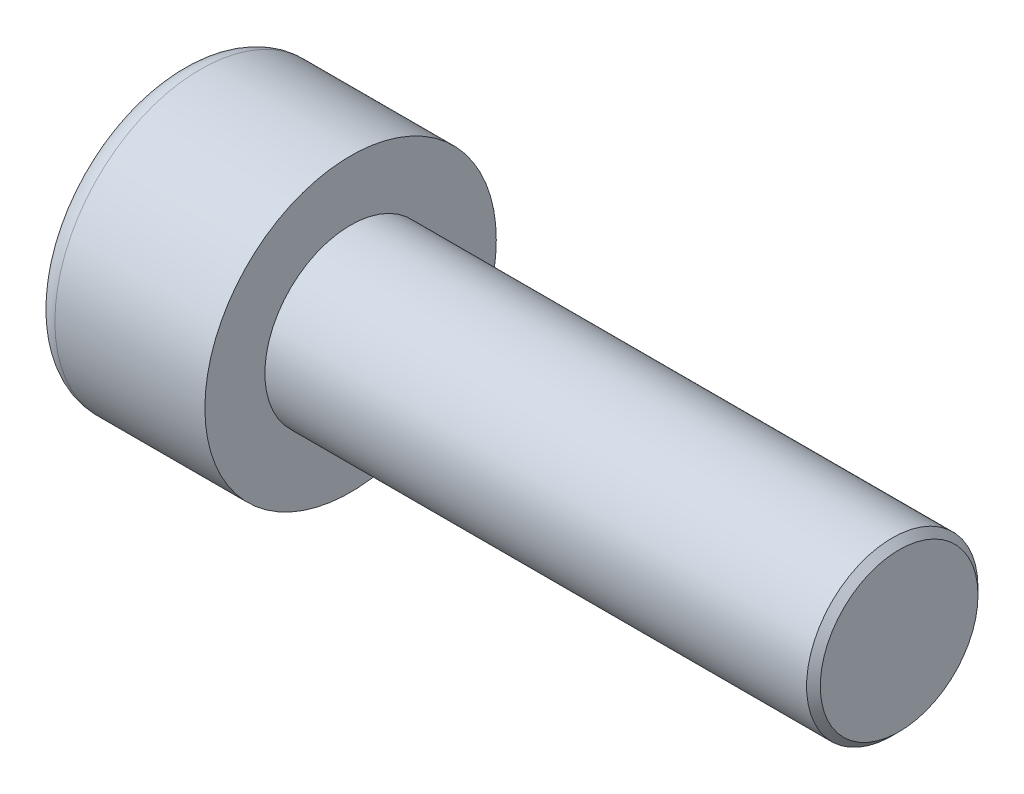
ISO-10303-21;
HEADER;
FILE_DESCRIPTION(('STEP AP214'),'2;1');
FILE_NAME('part.step','',(''),(''),'','','');
FILE_SCHEMA(('AUTOMOTIVE_DESIGN { 1 0 10303 214 1 1 1 1 }'));
ENDSEC;
DATA;
#1=APPLICATION_CONTEXT('core data for automotive mechanical design processes');
#2=APPLICATION_PROTOCOL_DEFINITION('international standard','automotive_design',2000,#1);
#3=PRODUCT_CONTEXT('',#1,'mechanical');
#4=PRODUCT('Part','Part','',(#3));
#5=PRODUCT_RELATED_PRODUCT_CATEGORY('part','',(#4));
#6=PRODUCT_DEFINITION_FORMATION('','',#4);
#7=PRODUCT_DEFINITION_CONTEXT('part definition',#1,'design');
#8=PRODUCT_DEFINITION('design','',#6,#7);
#9=PRODUCT_DEFINITION_SHAPE('','',#8);
#10=(LENGTH_UNIT() NAMED_UNIT(*) SI_UNIT(.MILLI.,.METRE.));
#11=(NAMED_UNIT(*) PLANE_ANGLE_UNIT() SI_UNIT($,.RADIAN.));
#12=(NAMED_UNIT(*) SI_UNIT($,.STERADIAN.) SOLID_ANGLE_UNIT());
#13=UNCERTAINTY_MEASURE_WITH_UNIT(LENGTH_MEASURE(1.E-05),#10,'distance_accuracy_value','');
#14=(GEOMETRIC_REPRESENTATION_CONTEXT(3) GLOBAL_UNCERTAINTY_ASSIGNED_CONTEXT((#13)) GLOBAL_UNIT_ASSIGNED_CONTEXT((#10,
#11,#12)) REPRESENTATION_CONTEXT('',''));
#15=CARTESIAN_POINT('',(0.,0.,0.));
#16=DIRECTION('',(0.,0.,1.));
#17=DIRECTION('',(1.,0.,0.));
#18=AXIS2_PLACEMENT_3D('',#15,#16,#17);
#19=CARTESIAN_POINT('',(2.5,0.,-2.3094010767585));
#20=DIRECTION('',(1.,0.,0.));
#21=DIRECTION('',(0.,0.,-1.));
#22=AXIS2_PLACEMENT_3D('',#19,#20,#21);
#23=PLANE('',#22);
#24=CARTESIAN_POINT('',(2.5,0.,0.));
#25=DIRECTION('',(1.,0.,0.));
#26=DIRECTION('',(0.,0.,-1.));
#27=AXIS2_PLACEMENT_3D('',#24,#25,#26);
#28=CIRCLE('',#27,2.);
#29=CARTESIAN_POINT('',(2.5,-1.,-1.73205080756888));
#30=VERTEX_POINT('',#29);
#31=CARTESIAN_POINT('',(2.5,-2.,0.));
#32=VERTEX_POINT('',#31);
#33=EDGE_CURVE('E160',#30,#32,#28,.F.);
#34=ORIENTED_EDGE('',*,*,#33,.F.);
#35=DIRECTION('',(0.,0.866025403784439,-0.5));
#36=VECTOR('',#35,1.);
#37=CARTESIAN_POINT('',(2.5,-2.,-1.15470053837925));
#38=LINE('',#37,#36);
#39=CARTESIAN_POINT('',(2.5,-2.,-1.15470053837925));
#40=VERTEX_POINT('',#39);
#41=EDGE_CURVE('E168',#40,#30,#38,.T.);
#42=ORIENTED_EDGE('',*,*,#41,.F.);
#43=DIRECTION('',(0.,0.,-1.));
#44=VECTOR('',#43,1.);
#45=CARTESIAN_POINT('',(2.5,-2.,1.15470053837925));
#46=LINE('',#45,#44);
#47=EDGE_CURVE('E185',#32,#40,#46,.T.);
#48=ORIENTED_EDGE('',*,*,#47,.F.);
#49=EDGE_LOOP('',(#34,#42,#48));
#50=FACE_BOUND('',#49,.T.);
#51=ADVANCED_FACE('F37',(#50),#23,.F.);
#52=CARTESIAN_POINT('',(2.5,-1.,1.73205080756888));
#53=VERTEX_POINT('',#52);
#54=EDGE_CURVE('E290',#32,#53,#28,.F.);
#55=ORIENTED_EDGE('',*,*,#54,.F.);
#56=CARTESIAN_POINT('',(2.5,-2.,1.15470053837925));
#57=VERTEX_POINT('',#56);
#58=EDGE_CURVE('E186',#57,#32,#46,.T.);
#59=ORIENTED_EDGE('',*,*,#58,.F.);
#60=DIRECTION('',(0.,-0.866025403784439,-0.5));
#61=VECTOR('',#60,1.);
#62=CARTESIAN_POINT('',(2.5,0.,2.3094010767585));
#63=LINE('',#62,#61);
#64=EDGE_CURVE('E181',#53,#57,#63,.T.);
#65=ORIENTED_EDGE('',*,*,#64,.F.);
#66=EDGE_LOOP('',(#55,#59,#65));
#67=FACE_BOUND('',#66,.T.);
#68=ADVANCED_FACE('F126',(#67),#23,.F.);
#69=CARTESIAN_POINT('',(2.5,1.,1.73205080756888));
#70=VERTEX_POINT('',#69);
#71=EDGE_CURVE('E286',#53,#70,#28,.F.);
#72=ORIENTED_EDGE('',*,*,#71,.F.);
#73=CARTESIAN_POINT('',(2.5,0.,2.3094010767585));
#74=VERTEX_POINT('',#73);
#75=EDGE_CURVE('E182',#74,#53,#63,.T.);
#76=ORIENTED_EDGE('',*,*,#75,.F.);
#77=DIRECTION('',(0.,-0.866025403784438,0.5));
#78=VECTOR('',#77,1.);
#79=CARTESIAN_POINT('',(2.5,2.,1.15470053837925));
#80=LINE('',#79,#78);
#81=EDGE_CURVE('E177',#70,#74,#80,.T.);
#82=ORIENTED_EDGE('',*,*,#81,.F.);
#83=EDGE_LOOP('',(#72,#76,#82));
#84=FACE_BOUND('',#83,.T.);
#85=ADVANCED_FACE('F132',(#84),#23,.F.);
#86=CARTESIAN_POINT('',(2.5,2.,0.));
#87=VERTEX_POINT('',#86);
#88=EDGE_CURVE('E157',#70,#87,#28,.F.);
#89=ORIENTED_EDGE('',*,*,#88,.F.);
#90=CARTESIAN_POINT('',(2.5,2.,1.15470053837925));
#91=VERTEX_POINT('',#90);
#92=EDGE_CURVE('E178',#91,#70,#80,.T.);
#93=ORIENTED_EDGE('',*,*,#92,.F.);
#94=DIRECTION('',(0.,0.,1.));
#95=VECTOR('',#94,1.);
#96=CARTESIAN_POINT('',(2.5,2.,-1.15470053837925));
#97=LINE('',#96,#95);
#98=EDGE_CURVE('E172',#87,#91,#97,.T.);
#99=ORIENTED_EDGE('',*,*,#98,.F.);
#100=EDGE_LOOP('',(#89,#93,#99));
#101=FACE_BOUND('',#100,.T.);
#102=ADVANCED_FACE('F146',(#101),#23,.F.);
#103=CARTESIAN_POINT('',(2.5,0.,0.));
#104=DIRECTION('',(1.,0.,0.));
#105=DIRECTION('',(0.,0.,-1.));
#106=AXIS2_PLACEMENT_3D('',#103,#104,#105);
#107=CIRCLE('',#106,2.);
#108=CARTESIAN_POINT('',(2.5,1.,-1.73205080756888));
#109=VERTEX_POINT('',#108);
#110=EDGE_CURVE('E52',#109,#87,#107,.T.);
#111=ORIENTED_EDGE('',*,*,#110,.T.);
#112=CARTESIAN_POINT('',(2.5,2.,-1.15470053837925));
#113=VERTEX_POINT('',#112);
#114=EDGE_CURVE('E165',#113,#87,#97,.T.);
#115=ORIENTED_EDGE('',*,*,#114,.F.);
#116=DIRECTION('',(0.,0.866025403784438,0.5));
#117=VECTOR('',#116,1.);
#118=CARTESIAN_POINT('',(2.5,0.,-2.3094010767585));
#119=LINE('',#118,#117);
#120=EDGE_CURVE('E162',#109,#113,#119,.T.);
#121=ORIENTED_EDGE('',*,*,#120,.F.);
#122=EDGE_LOOP('',(#111,#115,#121));
#123=FACE_BOUND('',#122,.T.);
#124=ADVANCED_FACE('F137',(#123),#23,.F.);
#125=EDGE_CURVE('E150',#109,#30,#28,.F.);
#126=ORIENTED_EDGE('',*,*,#125,.F.);
#127=CARTESIAN_POINT('',(2.5,0.,-2.3094010767585));
#128=VERTEX_POINT('',#127);
#129=EDGE_CURVE('E153',#128,#109,#119,.T.);
#130=ORIENTED_EDGE('',*,*,#129,.F.);
#131=EDGE_CURVE('E155',#30,#128,#38,.T.);
#132=ORIENTED_EDGE('',*,*,#131,.F.);
#133=EDGE_LOOP('',(#126,#130,#132));
#134=FACE_BOUND('',#133,.T.);
#135=ADVANCED_FACE('F128',(#134),#23,.F.);
#136=CARTESIAN_POINT('',(0.,0.,0.));
#137=DIRECTION('',(1.,0.,0.));
#138=DIRECTION('',(0.,0.,-1.));
#139=AXIS2_PLACEMENT_3D('',#136,#137,#138);
#140=PLANE('',#139);
#141=CARTESIAN_POINT('',(0.,0.,0.));
#142=DIRECTION('',(1.,0.,0.));
#143=DIRECTION('',(0.,0.,-1.));
#144=AXIS2_PLACEMENT_3D('',#141,#142,#143);
#145=CIRCLE('',#144,3.625);
#146=CARTESIAN_POINT('',(0.,0.,-3.625));
#147=VERTEX_POINT('',#146);
#148=EDGE_CURVE('E225',#147,#147,#145,.F.);
#149=ORIENTED_EDGE('',*,*,#148,.T.);
#150=EDGE_LOOP('',(#149));
#151=FACE_BOUND('',#150,.T.);
#152=DIRECTION('',(0.,0.866025403784439,-0.5));
#153=VECTOR('',#152,1.);
#154=CARTESIAN_POINT('',(0.,-2.,-1.15470053837925));
#155=LINE('',#154,#153);
#156=CARTESIAN_POINT('',(0.,-2.,-1.15470053837925));
#157=VERTEX_POINT('',#156);
#158=CARTESIAN_POINT('',(0.,0.,-2.3094010767585));
#159=VERTEX_POINT('',#158);
#160=EDGE_CURVE('E60',#157,#159,#155,.T.);
#161=ORIENTED_EDGE('',*,*,#160,.T.);
#162=DIRECTION('',(0.,0.866025403784438,0.5));
#163=VECTOR('',#162,1.);
#164=CARTESIAN_POINT('',(0.,0.,-2.3094010767585));
#165=LINE('',#164,#163);
#166=CARTESIAN_POINT('',(0.,2.,-1.15470053837925));
#167=VERTEX_POINT('',#166);
#168=EDGE_CURVE('E191',#159,#167,#165,.T.);
#169=ORIENTED_EDGE('',*,*,#168,.T.);
#170=DIRECTION('',(0.,0.,1.));
#171=VECTOR('',#170,1.);
#172=CARTESIAN_POINT('',(0.,2.,-1.15470053837925));
#173=LINE('',#172,#171);
#174=CARTESIAN_POINT('',(0.,2.,1.15470053837925));
#175=VERTEX_POINT('',#174);
#176=EDGE_CURVE('E194',#167,#175,#173,.T.);
#177=ORIENTED_EDGE('',*,*,#176,.T.);
#178=DIRECTION('',(0.,-0.866025403784438,0.5));
#179=VECTOR('',#178,1.);
#180=CARTESIAN_POINT('',(0.,2.,1.15470053837925));
#181=LINE('',#180,#179);
#182=CARTESIAN_POINT('',(0.,0.,2.3094010767585));
#183=VERTEX_POINT('',#182);
#184=EDGE_CURVE('E197',#175,#183,#181,.T.);
#185=ORIENTED_EDGE('',*,*,#184,.T.);
#186=DIRECTION('',(0.,-0.866025403784439,-0.5));
#187=VECTOR('',#186,1.);
#188=CARTESIAN_POINT('',(0.,0.,2.3094010767585));
#189=LINE('',#188,#187);
#190=CARTESIAN_POINT('',(0.,-2.,1.15470053837925));
#191=VERTEX_POINT('',#190);
#192=EDGE_CURVE('E200',#183,#191,#189,.T.);
#193=ORIENTED_EDGE('',*,*,#192,.T.);
#194=DIRECTION('',(0.,0.,-1.));
#195=VECTOR('',#194,1.);
#196=CARTESIAN_POINT('',(0.,-2.,1.15470053837925));
#197=LINE('',#196,#195);
#198=EDGE_CURVE('E203',#191,#157,#197,.T.);
#199=ORIENTED_EDGE('',*,*,#198,.T.);
#200=EDGE_LOOP('',(#161,#169,#177,#185,#193,#199));
#201=FACE_BOUND('',#200,.T.);
#202=ADVANCED_FACE('F136',(#151,#201),#140,.F.);
#203=CARTESIAN_POINT('',(5.,0.,0.));
#204=DIRECTION('',(1.,0.,0.));
#205=DIRECTION('',(0.,0.,-1.));
#206=AXIS2_PLACEMENT_3D('',#203,#204,#205);
#207=PLANE('',#206);
#208=CARTESIAN_POINT('',(5.,0.,0.));
#209=DIRECTION('',(1.,0.,0.));
#210=DIRECTION('',(0.,0.,-1.));
#211=AXIS2_PLACEMENT_3D('',#208,#209,#210);
#212=CIRCLE('',#211,4.25);
#213=CARTESIAN_POINT('',(5.,0.,-4.25));
#214=VERTEX_POINT('',#213);
#215=EDGE_CURVE('E158',#214,#214,#212,.T.);
#216=ORIENTED_EDGE('',*,*,#215,.T.);
#217=EDGE_LOOP('',(#216));
#218=FACE_BOUND('',#217,.T.);
#219=CARTESIAN_POINT('',(5.,0.,0.));
#220=DIRECTION('',(1.,0.,0.));
#221=DIRECTION('',(0.,0.,-1.));
#222=AXIS2_PLACEMENT_3D('',#219,#220,#221);
#223=CIRCLE('',#222,2.5);
#224=CARTESIAN_POINT('',(5.,0.,-2.5));
#225=VERTEX_POINT('',#224);
#226=EDGE_CURVE('E216',#225,#225,#223,.T.);
#227=ORIENTED_EDGE('',*,*,#226,.F.);
#228=EDGE_LOOP('',(#227));
#229=FACE_BOUND('',#228,.T.);
#230=ADVANCED_FACE('F143',(#218,#229),#207,.T.);
#231=CARTESIAN_POINT('',(5.,0.,0.));
#232=DIRECTION('',(-1.,0.,0.));
#233=DIRECTION('',(0.,0.,1.));
#234=AXIS2_PLACEMENT_3D('',#231,#232,#233);
#235=CYLINDRICAL_SURFACE('',#234,4.25);
#236=CARTESIAN_POINT('',(0.625,0.,0.));
#237=DIRECTION('',(1.,0.,0.));
#238=DIRECTION('',(0.,0.,-1.));
#239=AXIS2_PLACEMENT_3D('',#236,#237,#238);
#240=CIRCLE('',#239,4.25);
#241=CARTESIAN_POINT('',(0.625,0.,-4.25));
#242=VERTEX_POINT('',#241);
#243=EDGE_CURVE('E222',#242,#242,#240,.T.);
#244=ORIENTED_EDGE('',*,*,#243,.T.);
#245=EDGE_LOOP('',(#244));
#246=FACE_BOUND('',#245,.T.);
#247=ORIENTED_EDGE('',*,*,#215,.F.);
#248=EDGE_LOOP('',(#247));
#249=FACE_BOUND('',#248,.T.);
#250=ADVANCED_FACE('F241',(#246,#249),#235,.T.);
#251=CARTESIAN_POINT('',(21.,0.,0.));
#252=DIRECTION('',(-1.,0.,0.));
#253=DIRECTION('',(0.,0.,1.));
#254=AXIS2_PLACEMENT_3D('',#251,#252,#253);
#255=CYLINDRICAL_SURFACE('',#254,2.5);
#256=CARTESIAN_POINT('',(20.8,0.,0.));
#257=DIRECTION('',(1.,0.,0.));
#258=DIRECTION('',(0.,0.,-1.));
#259=AXIS2_PLACEMENT_3D('',#256,#257,#258);
#260=CIRCLE('',#259,2.5);
#261=CARTESIAN_POINT('',(20.8,0.,-2.5));
#262=VERTEX_POINT('',#261);
#263=EDGE_CURVE('E11',#262,#262,#260,.F.);
#264=ORIENTED_EDGE('',*,*,#263,.T.);
#265=EDGE_LOOP('',(#264));
#266=FACE_BOUND('',#265,.T.);
#267=ORIENTED_EDGE('',*,*,#226,.T.);
#268=EDGE_LOOP('',(#267));
#269=FACE_BOUND('',#268,.T.);
#270=ADVANCED_FACE('F238',(#266,#269),#255,.T.);
#271=CARTESIAN_POINT('',(21.,0.,0.));
#272=DIRECTION('',(1.,0.,0.));
#273=DIRECTION('',(0.,0.,-1.));
#274=AXIS2_PLACEMENT_3D('',#271,#272,#273);
#275=PLANE('',#274);
#276=CARTESIAN_POINT('',(21.,0.,0.));
#277=DIRECTION('',(1.,0.,0.));
#278=DIRECTION('',(0.,0.,-1.));
#279=AXIS2_PLACEMENT_3D('',#276,#277,#278);
#280=CIRCLE('',#279,2.3);
#281=CARTESIAN_POINT('',(21.,0.,-2.3));
#282=VERTEX_POINT('',#281);
#283=EDGE_CURVE('E45',#282,#282,#280,.T.);
#284=ORIENTED_EDGE('',*,*,#283,.T.);
#285=EDGE_LOOP('',(#284));
#286=FACE_BOUND('',#285,.T.);
#287=ADVANCED_FACE('F230',(#286),#275,.T.);
#288=CARTESIAN_POINT('',(2.5,-2.,-1.15470053837925));
#289=DIRECTION('',(0.,0.5,0.866025403784439));
#290=DIRECTION('',(0.,-0.866025403784439,0.5));
#291=AXIS2_PLACEMENT_3D('',#288,#289,#290);
#292=PLANE('',#291);
#293=ORIENTED_EDGE('',*,*,#160,.F.);
#294=DIRECTION('',(-1.,0.,0.));
#295=VECTOR('',#294,1.);
#296=CARTESIAN_POINT('',(2.5,-2.,-1.15470053837925));
#297=LINE('',#296,#295);
#298=EDGE_CURVE('E189',#40,#157,#297,.T.);
#299=ORIENTED_EDGE('',*,*,#298,.F.);
#300=ORIENTED_EDGE('',*,*,#41,.T.);
#301=ORIENTED_EDGE('',*,*,#131,.T.);
#302=DIRECTION('',(-1.,0.,0.));
#303=VECTOR('',#302,1.);
#304=CARTESIAN_POINT('',(2.5,0.,-2.3094010767585));
#305=LINE('',#304,#303);
#306=EDGE_CURVE('E171',#128,#159,#305,.T.);
#307=ORIENTED_EDGE('',*,*,#306,.T.);
#308=EDGE_LOOP('',(#293,#299,#300,#301,#307));
#309=FACE_BOUND('',#308,.T.);
#310=ADVANCED_FACE('F256',(#309),#292,.T.);
#311=CARTESIAN_POINT('',(2.5,0.,-2.3094010767585));
#312=DIRECTION('',(0.,-0.5,0.866025403784438));
#313=DIRECTION('',(0.,-0.866025403784438,-0.5));
#314=AXIS2_PLACEMENT_3D('',#311,#312,#313);
#315=PLANE('',#314);
#316=ORIENTED_EDGE('',*,*,#168,.F.);
#317=ORIENTED_EDGE('',*,*,#306,.F.);
#318=ORIENTED_EDGE('',*,*,#129,.T.);
#319=ORIENTED_EDGE('',*,*,#120,.T.);
#320=DIRECTION('',(-1.,0.,0.));
#321=VECTOR('',#320,1.);
#322=CARTESIAN_POINT('',(2.5,2.,-1.15470053837925));
#323=LINE('',#322,#321);
#324=EDGE_CURVE('E213',#113,#167,#323,.T.);
#325=ORIENTED_EDGE('',*,*,#324,.T.);
#326=EDGE_LOOP('',(#316,#317,#318,#319,#325));
#327=FACE_BOUND('',#326,.T.);
#328=ADVANCED_FACE('F170',(#327),#315,.T.);
#329=CARTESIAN_POINT('',(2.5,2.,-1.15470053837925));
#330=DIRECTION('',(0.,-1.,0.));
#331=DIRECTION('',(0.,0.,-1.));
#332=AXIS2_PLACEMENT_3D('',#329,#330,#331);
#333=PLANE('',#332);
#334=ORIENTED_EDGE('',*,*,#176,.F.);
#335=ORIENTED_EDGE('',*,*,#324,.F.);
#336=ORIENTED_EDGE('',*,*,#114,.T.);
#337=ORIENTED_EDGE('',*,*,#98,.T.);
#338=DIRECTION('',(-1.,0.,0.));
#339=VECTOR('',#338,1.);
#340=CARTESIAN_POINT('',(2.5,2.,1.15470053837925));
#341=LINE('',#340,#339);
#342=EDGE_CURVE('E211',#91,#175,#341,.T.);
#343=ORIENTED_EDGE('',*,*,#342,.T.);
#344=EDGE_LOOP('',(#334,#335,#336,#337,#343));
#345=FACE_BOUND('',#344,.T.);
#346=ADVANCED_FACE('F261',(#345),#333,.T.);
#347=CARTESIAN_POINT('',(2.5,2.,1.15470053837925));
#348=DIRECTION('',(0.,-0.5,-0.866025403784439));
#349=DIRECTION('',(0.,0.866025403784439,-0.5));
#350=AXIS2_PLACEMENT_3D('',#347,#348,#349);
#351=PLANE('',#350);
#352=ORIENTED_EDGE('',*,*,#184,.F.);
#353=ORIENTED_EDGE('',*,*,#342,.F.);
#354=ORIENTED_EDGE('',*,*,#92,.T.);
#355=ORIENTED_EDGE('',*,*,#81,.T.);
#356=DIRECTION('',(-1.,0.,0.));
#357=VECTOR('',#356,1.);
#358=CARTESIAN_POINT('',(2.5,0.,2.3094010767585));
#359=LINE('',#358,#357);
#360=EDGE_CURVE('E209',#74,#183,#359,.T.);
#361=ORIENTED_EDGE('',*,*,#360,.T.);
#362=EDGE_LOOP('',(#352,#353,#354,#355,#361));
#363=FACE_BOUND('',#362,.T.);
#364=ADVANCED_FACE('F264',(#363),#351,.T.);
#365=CARTESIAN_POINT('',(2.5,0.,2.3094010767585));
#366=DIRECTION('',(0.,0.5,-0.866025403784438));
#367=DIRECTION('',(0.,0.866025403784439,0.5));
#368=AXIS2_PLACEMENT_3D('',#365,#366,#367);
#369=PLANE('',#368);
#370=ORIENTED_EDGE('',*,*,#192,.F.);
#371=ORIENTED_EDGE('',*,*,#360,.F.);
#372=ORIENTED_EDGE('',*,*,#75,.T.);
#373=ORIENTED_EDGE('',*,*,#64,.T.);
#374=DIRECTION('',(-1.,0.,0.));
#375=VECTOR('',#374,1.);
#376=CARTESIAN_POINT('',(2.5,-2.,1.15470053837925));
#377=LINE('',#376,#375);
#378=EDGE_CURVE('E207',#57,#191,#377,.T.);
#379=ORIENTED_EDGE('',*,*,#378,.T.);
#380=EDGE_LOOP('',(#370,#371,#372,#373,#379));
#381=FACE_BOUND('',#380,.T.);
#382=ADVANCED_FACE('F121',(#381),#369,.T.);
#383=CARTESIAN_POINT('',(2.5,-2.,1.15470053837925));
#384=DIRECTION('',(0.,1.,0.));
#385=DIRECTION('',(0.,0.,1.));
#386=AXIS2_PLACEMENT_3D('',#383,#384,#385);
#387=PLANE('',#386);
#388=ORIENTED_EDGE('',*,*,#198,.F.);
#389=ORIENTED_EDGE('',*,*,#378,.F.);
#390=ORIENTED_EDGE('',*,*,#58,.T.);
#391=ORIENTED_EDGE('',*,*,#47,.T.);
#392=ORIENTED_EDGE('',*,*,#298,.T.);
#393=EDGE_LOOP('',(#388,#389,#390,#391,#392));
#394=FACE_BOUND('',#393,.T.);
#395=ADVANCED_FACE('F114',(#394),#387,.T.);
#396=CARTESIAN_POINT('',(2.5,0.,0.));
#397=DIRECTION('',(-1.,0.,0.));
#398=DIRECTION('',(0.,0.,1.));
#399=AXIS2_PLACEMENT_3D('',#396,#397,#398);
#400=CONICAL_SURFACE('',#399,2.,1.04719755119659);
#401=CARTESIAN_POINT('',(3.65470053837926,0.,0.));
#402=VERTEX_POINT('',#401);
#403=VERTEX_LOOP('',#402);
#404=FACE_BOUND('',#403,.T.);
#405=ORIENTED_EDGE('',*,*,#110,.F.);
#406=ORIENTED_EDGE('',*,*,#125,.T.);
#407=ORIENTED_EDGE('',*,*,#33,.T.);
#408=ORIENTED_EDGE('',*,*,#54,.T.);
#409=ORIENTED_EDGE('',*,*,#71,.T.);
#410=ORIENTED_EDGE('',*,*,#88,.T.);
#411=EDGE_LOOP('',(#405,#406,#407,#408,#409,#410));
#412=FACE_BOUND('',#411,.T.);
#413=ADVANCED_FACE('F111',(#404,#412),#400,.F.);
#414=CARTESIAN_POINT('',(0.625,0.,0.));
#415=DIRECTION('',(1.,0.,0.));
#416=DIRECTION('',(0.,0.,-1.));
#417=AXIS2_PLACEMENT_3D('',#414,#415,#416);
#418=TOROIDAL_SURFACE('',#417,3.625,0.625);
#419=ORIENTED_EDGE('',*,*,#148,.F.);
#420=EDGE_LOOP('',(#419));
#421=FACE_BOUND('',#420,.T.);
#422=ORIENTED_EDGE('',*,*,#243,.F.);
#423=EDGE_LOOP('',(#422));
#424=FACE_BOUND('',#423,.T.);
#425=ADVANCED_FACE('F113',(#421,#424),#418,.T.);
#426=CARTESIAN_POINT('',(21.,0.,0.));
#427=DIRECTION('',(-1.,0.,0.));
#428=DIRECTION('',(0.,0.,1.));
#429=AXIS2_PLACEMENT_3D('',#426,#427,#428);
#430=CONICAL_SURFACE('',#429,2.3,0.785398163397443);
#431=ORIENTED_EDGE('',*,*,#263,.F.);
#432=EDGE_LOOP('',(#431));
#433=FACE_BOUND('',#432,.T.);
#434=ORIENTED_EDGE('',*,*,#283,.F.);
#435=EDGE_LOOP('',(#434));
#436=FACE_BOUND('',#435,.T.);
#437=ADVANCED_FACE('F39',(#433,#436),#430,.T.);
#438=CLOSED_SHELL('',(#51,#68,#85,#102,#124,#135,#202,#230,#250,#270,#287,#310,#328,#346,#364,
#382,#395,#413,#425,#437));
#439=MANIFOLD_SOLID_BREP('B2',#438);
#440=ADVANCED_BREP_SHAPE_REPRESENTATION('',(#18,#439),#14);
#441=SHAPE_DEFINITION_REPRESENTATION(#9,#440);
ENDSEC;
END-ISO-10303-21;
